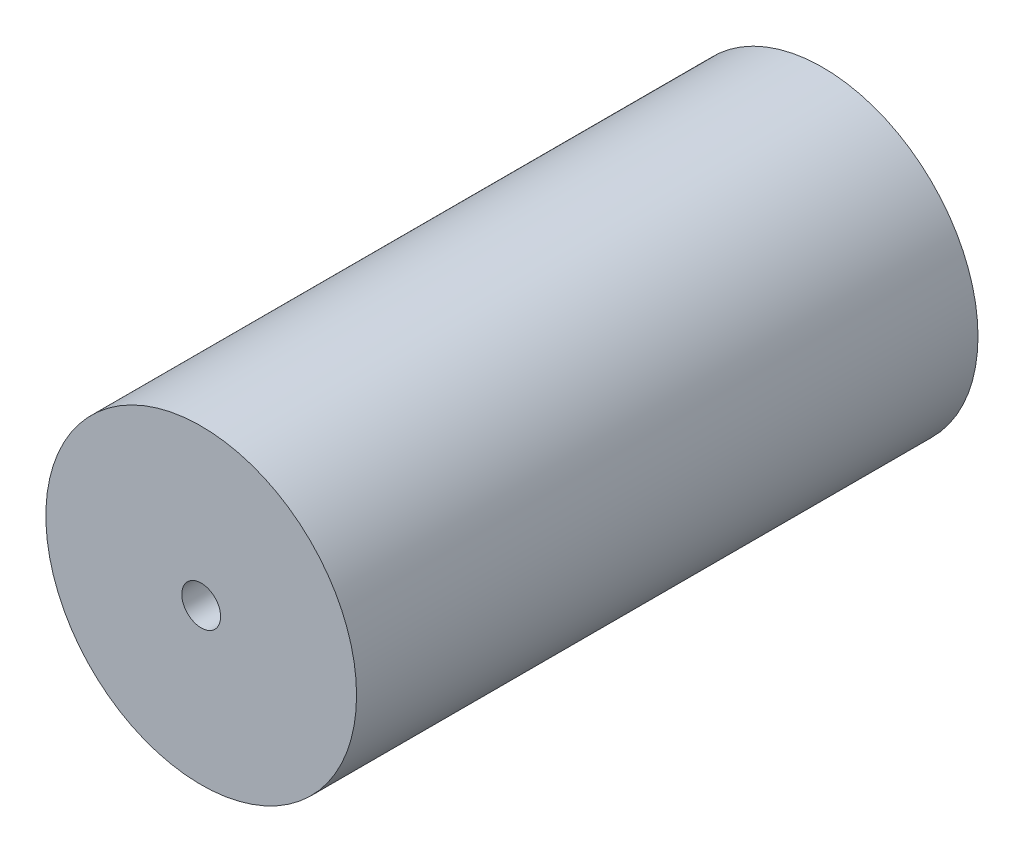
ISO-10303-21;
HEADER;
FILE_DESCRIPTION(('STEP AP214'),'2;1');
FILE_NAME('part.step','',(''),(''),'','','');
FILE_SCHEMA(('AUTOMOTIVE_DESIGN { 1 0 10303 214 1 1 1 1 }'));
ENDSEC;
DATA;
#1=APPLICATION_CONTEXT('core data for automotive mechanical design processes');
#2=APPLICATION_PROTOCOL_DEFINITION('international standard','automotive_design',2000,#1);
#3=PRODUCT_CONTEXT('',#1,'mechanical');
#4=PRODUCT('Part','Part','',(#3));
#5=PRODUCT_RELATED_PRODUCT_CATEGORY('part','',(#4));
#6=PRODUCT_DEFINITION_FORMATION('','',#4);
#7=PRODUCT_DEFINITION_CONTEXT('part definition',#1,'design');
#8=PRODUCT_DEFINITION('design','',#6,#7);
#9=PRODUCT_DEFINITION_SHAPE('','',#8);
#10=(LENGTH_UNIT() NAMED_UNIT(*) SI_UNIT(.MILLI.,.METRE.));
#11=(NAMED_UNIT(*) PLANE_ANGLE_UNIT() SI_UNIT($,.RADIAN.));
#12=(NAMED_UNIT(*) SI_UNIT($,.STERADIAN.) SOLID_ANGLE_UNIT());
#13=UNCERTAINTY_MEASURE_WITH_UNIT(LENGTH_MEASURE(1.E-05),#10,'distance_accuracy_value','');
#14=(GEOMETRIC_REPRESENTATION_CONTEXT(3) GLOBAL_UNCERTAINTY_ASSIGNED_CONTEXT((#13)) GLOBAL_UNIT_ASSIGNED_CONTEXT((#10,
#11,#12)) REPRESENTATION_CONTEXT('',''));
#15=CARTESIAN_POINT('',(0.,0.,0.));
#16=DIRECTION('',(0.,0.,1.));
#17=DIRECTION('',(1.,0.,0.));
#18=AXIS2_PLACEMENT_3D('',#15,#16,#17);
#19=CARTESIAN_POINT('',(0.,0.,80.));
#20=DIRECTION('',(0.,0.,1.));
#21=DIRECTION('',(1.,0.,0.));
#22=AXIS2_PLACEMENT_3D('',#19,#20,#21);
#23=PLANE('',#22);
#24=CARTESIAN_POINT('',(0.,0.,80.));
#25=DIRECTION('',(0.,0.,1.));
#26=DIRECTION('',(1.,0.,0.));
#27=AXIS2_PLACEMENT_3D('',#24,#25,#26);
#28=CIRCLE('',#27,20.);
#29=CARTESIAN_POINT('',(20.,0.,80.));
#30=VERTEX_POINT('',#29);
#31=EDGE_CURVE('E10',#30,#30,#28,.T.);
#32=ORIENTED_EDGE('',*,*,#31,.T.);
#33=EDGE_LOOP('',(#32));
#34=FACE_BOUND('',#33,.T.);
#35=CARTESIAN_POINT('',(0.,0.,80.));
#36=DIRECTION('',(0.,0.,1.));
#37=DIRECTION('',(1.,0.,0.));
#38=AXIS2_PLACEMENT_3D('',#35,#36,#37);
#39=CIRCLE('',#38,2.5);
#40=CARTESIAN_POINT('',(2.5,0.,80.));
#41=VERTEX_POINT('',#40);
#42=EDGE_CURVE('E50',#41,#41,#39,.T.);
#43=ORIENTED_EDGE('',*,*,#42,.F.);
#44=EDGE_LOOP('',(#43));
#45=FACE_BOUND('',#44,.T.);
#46=ADVANCED_FACE('F37',(#34,#45),#23,.T.);
#47=CARTESIAN_POINT('',(0.,0.,0.));
#48=DIRECTION('',(0.,0.,1.));
#49=DIRECTION('',(1.,0.,0.));
#50=AXIS2_PLACEMENT_3D('',#47,#48,#49);
#51=PLANE('',#50);
#52=CARTESIAN_POINT('',(0.,0.,0.));
#53=DIRECTION('',(0.,0.,1.));
#54=DIRECTION('',(1.,0.,0.));
#55=AXIS2_PLACEMENT_3D('',#52,#53,#54);
#56=CIRCLE('',#55,20.);
#57=CARTESIAN_POINT('',(20.,0.,0.));
#58=VERTEX_POINT('',#57);
#59=EDGE_CURVE('E41',#58,#58,#56,.T.);
#60=ORIENTED_EDGE('',*,*,#59,.F.);
#61=EDGE_LOOP('',(#60));
#62=FACE_BOUND('',#61,.T.);
#63=CARTESIAN_POINT('',(0.,0.,0.));
#64=DIRECTION('',(0.,0.,1.));
#65=DIRECTION('',(1.,0.,0.));
#66=AXIS2_PLACEMENT_3D('',#63,#64,#65);
#67=CIRCLE('',#66,2.5);
#68=CARTESIAN_POINT('',(2.5,0.,0.));
#69=VERTEX_POINT('',#68);
#70=EDGE_CURVE('E52',#69,#69,#67,.T.);
#71=ORIENTED_EDGE('',*,*,#70,.T.);
#72=EDGE_LOOP('',(#71));
#73=FACE_BOUND('',#72,.T.);
#74=ADVANCED_FACE('F64',(#62,#73),#51,.F.);
#75=CARTESIAN_POINT('',(0.,0.,80.));
#76=DIRECTION('',(0.,0.,-1.));
#77=DIRECTION('',(-1.,0.,0.));
#78=AXIS2_PLACEMENT_3D('',#75,#76,#77);
#79=CYLINDRICAL_SURFACE('',#78,20.);
#80=ORIENTED_EDGE('',*,*,#31,.F.);
#81=EDGE_LOOP('',(#80));
#82=FACE_BOUND('',#81,.T.);
#83=ORIENTED_EDGE('',*,*,#59,.T.);
#84=EDGE_LOOP('',(#83));
#85=FACE_BOUND('',#84,.T.);
#86=ADVANCED_FACE('F39',(#82,#85),#79,.T.);
#87=CARTESIAN_POINT('',(0.,0.,80.));
#88=DIRECTION('',(0.,0.,-1.));
#89=DIRECTION('',(-1.,0.,0.));
#90=AXIS2_PLACEMENT_3D('',#87,#88,#89);
#91=CYLINDRICAL_SURFACE('',#90,2.5);
#92=ORIENTED_EDGE('',*,*,#42,.T.);
#93=EDGE_LOOP('',(#92));
#94=FACE_BOUND('',#93,.T.);
#95=ORIENTED_EDGE('',*,*,#70,.F.);
#96=EDGE_LOOP('',(#95));
#97=FACE_BOUND('',#96,.T.);
#98=ADVANCED_FACE('F60',(#94,#97),#91,.F.);
#99=CLOSED_SHELL('',(#46,#74,#86,#98));
#100=MANIFOLD_SOLID_BREP('B2',#99);
#101=ADVANCED_BREP_SHAPE_REPRESENTATION('',(#18,#100),#14);
#102=SHAPE_DEFINITION_REPRESENTATION(#9,#101);
ENDSEC;
END-ISO-10303-21;
